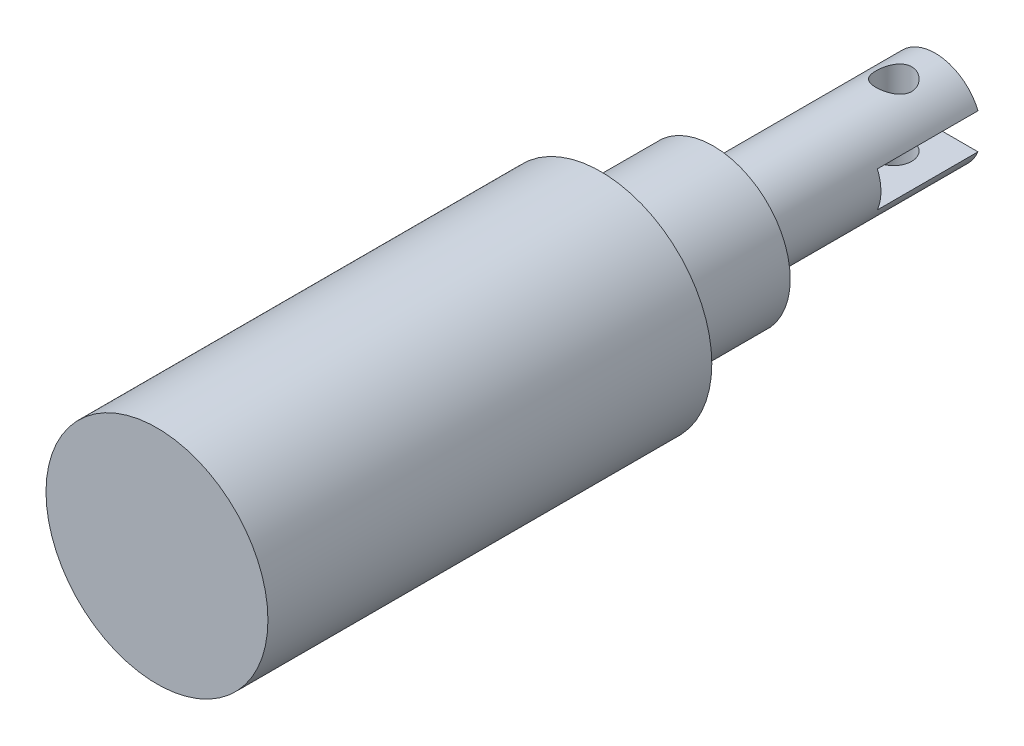
ISO-10303-21;
HEADER;
FILE_DESCRIPTION(('STEP AP214'),'2;1');
FILE_NAME('part.step','',(''),(''),'','','');
FILE_SCHEMA(('AUTOMOTIVE_DESIGN { 1 0 10303 214 1 1 1 1 }'));
ENDSEC;
DATA;
#1=APPLICATION_CONTEXT('core data for automotive mechanical design processes');
#2=APPLICATION_PROTOCOL_DEFINITION('international standard','automotive_design',2000,#1);
#3=PRODUCT_CONTEXT('',#1,'mechanical');
#4=PRODUCT('Part','Part','',(#3));
#5=PRODUCT_RELATED_PRODUCT_CATEGORY('part','',(#4));
#6=PRODUCT_DEFINITION_FORMATION('','',#4);
#7=PRODUCT_DEFINITION_CONTEXT('part definition',#1,'design');
#8=PRODUCT_DEFINITION('design','',#6,#7);
#9=PRODUCT_DEFINITION_SHAPE('','',#8);
#10=(LENGTH_UNIT() NAMED_UNIT(*) SI_UNIT(.MILLI.,.METRE.));
#11=(NAMED_UNIT(*) PLANE_ANGLE_UNIT() SI_UNIT($,.RADIAN.));
#12=(NAMED_UNIT(*) SI_UNIT($,.STERADIAN.) SOLID_ANGLE_UNIT());
#13=UNCERTAINTY_MEASURE_WITH_UNIT(LENGTH_MEASURE(1.E-05),#10,'distance_accuracy_value','');
#14=(GEOMETRIC_REPRESENTATION_CONTEXT(3) GLOBAL_UNCERTAINTY_ASSIGNED_CONTEXT((#13)) GLOBAL_UNIT_ASSIGNED_CONTEXT((#10,
#11,#12)) REPRESENTATION_CONTEXT('',''));
#15=CARTESIAN_POINT('',(0.,0.,0.));
#16=DIRECTION('',(0.,0.,1.));
#17=DIRECTION('',(1.,0.,0.));
#18=AXIS2_PLACEMENT_3D('',#15,#16,#17);
#19=CARTESIAN_POINT('',(0.,0.,-28.702));
#20=DIRECTION('',(0.,0.,-1.));
#21=DIRECTION('',(-1.,0.,0.));
#22=AXIS2_PLACEMENT_3D('',#19,#20,#21);
#23=PLANE('',#22);
#24=DIRECTION('',(1.,0.,0.));
#25=VECTOR('',#24,1.);
#26=CARTESIAN_POINT('',(0.,1.524,-28.702));
#27=LINE('',#26,#25);
#28=CARTESIAN_POINT('',(-3.67135451979239,1.524,-28.702));
#29=VERTEX_POINT('',#28);
#30=CARTESIAN_POINT('',(3.67135451979239,1.524,-28.702));
#31=VERTEX_POINT('',#30);
#32=EDGE_CURVE('E82',#29,#31,#27,.T.);
#33=ORIENTED_EDGE('',*,*,#32,.F.);
#34=CARTESIAN_POINT('',(0.,0.,-28.702));
#35=DIRECTION('',(0.,0.,-1.));
#36=DIRECTION('',(-1.,0.,0.));
#37=AXIS2_PLACEMENT_3D('',#34,#35,#36);
#38=CIRCLE('',#37,3.9751);
#39=EDGE_CURVE('E95',#29,#31,#38,.T.);
#40=ORIENTED_EDGE('',*,*,#39,.T.);
#41=EDGE_LOOP('',(#33,#40));
#42=FACE_BOUND('',#41,.T.);
#43=ADVANCED_FACE('F34',(#42),#23,.T.);
#44=CARTESIAN_POINT('',(0.,0.,-9.652));
#45=DIRECTION('',(0.,0.,-1.));
#46=DIRECTION('',(-1.,0.,0.));
#47=AXIS2_PLACEMENT_3D('',#44,#45,#46);
#48=PLANE('',#47);
#49=CARTESIAN_POINT('',(0.,0.,-9.652));
#50=DIRECTION('',(0.,0.,-1.));
#51=DIRECTION('',(-1.,0.,0.));
#52=AXIS2_PLACEMENT_3D('',#49,#50,#51);
#53=CIRCLE('',#52,6.604);
#54=CARTESIAN_POINT('',(-6.604,0.,-9.652));
#55=VERTEX_POINT('',#54);
#56=EDGE_CURVE('E99',#55,#55,#53,.T.);
#57=ORIENTED_EDGE('',*,*,#56,.T.);
#58=EDGE_LOOP('',(#57));
#59=FACE_BOUND('',#58,.T.);
#60=CARTESIAN_POINT('',(0.,0.,-9.652));
#61=DIRECTION('',(0.,0.,-1.));
#62=DIRECTION('',(-1.,0.,0.));
#63=AXIS2_PLACEMENT_3D('',#60,#61,#62);
#64=CIRCLE('',#63,3.9751);
#65=CARTESIAN_POINT('',(-3.9751,0.,-9.652));
#66=VERTEX_POINT('',#65);
#67=EDGE_CURVE('E96',#66,#66,#64,.T.);
#68=ORIENTED_EDGE('',*,*,#67,.F.);
#69=EDGE_LOOP('',(#68));
#70=FACE_BOUND('',#69,.T.);
#71=ADVANCED_FACE('F161',(#59,#70),#48,.T.);
#72=CARTESIAN_POINT('',(0.,0.,0.));
#73=DIRECTION('',(0.,0.,1.));
#74=DIRECTION('',(1.,0.,0.));
#75=AXIS2_PLACEMENT_3D('',#72,#73,#74);
#76=PLANE('',#75);
#77=CARTESIAN_POINT('',(0.,0.,0.));
#78=DIRECTION('',(0.,0.,1.));
#79=DIRECTION('',(1.,0.,0.));
#80=AXIS2_PLACEMENT_3D('',#77,#78,#79);
#81=CIRCLE('',#80,9.525);
#82=CARTESIAN_POINT('',(9.525,0.,0.));
#83=VERTEX_POINT('',#82);
#84=EDGE_CURVE('E107',#83,#83,#81,.T.);
#85=ORIENTED_EDGE('',*,*,#84,.F.);
#86=EDGE_LOOP('',(#85));
#87=FACE_BOUND('',#86,.T.);
#88=CARTESIAN_POINT('',(0.,0.,0.));
#89=DIRECTION('',(0.,0.,1.));
#90=DIRECTION('',(1.,0.,0.));
#91=AXIS2_PLACEMENT_3D('',#88,#89,#90);
#92=CIRCLE('',#91,6.604);
#93=CARTESIAN_POINT('',(6.604,0.,0.));
#94=VERTEX_POINT('',#93);
#95=EDGE_CURVE('E83',#94,#94,#92,.F.);
#96=ORIENTED_EDGE('',*,*,#95,.F.);
#97=EDGE_LOOP('',(#96));
#98=FACE_BOUND('',#97,.T.);
#99=ADVANCED_FACE('F166',(#87,#98),#76,.F.);
#100=CARTESIAN_POINT('',(0.,0.,38.1));
#101=DIRECTION('',(0.,0.,-1.));
#102=DIRECTION('',(-1.,0.,0.));
#103=AXIS2_PLACEMENT_3D('',#100,#101,#102);
#104=CYLINDRICAL_SURFACE('',#103,9.525);
#105=CARTESIAN_POINT('',(0.,0.,38.1));
#106=DIRECTION('',(0.,0.,1.));
#107=DIRECTION('',(1.,0.,0.));
#108=AXIS2_PLACEMENT_3D('',#105,#106,#107);
#109=CIRCLE('',#108,9.525);
#110=CARTESIAN_POINT('',(9.525,0.,38.1));
#111=VERTEX_POINT('',#110);
#112=EDGE_CURVE('E110',#111,#111,#109,.T.);
#113=ORIENTED_EDGE('',*,*,#112,.F.);
#114=EDGE_LOOP('',(#113));
#115=FACE_BOUND('',#114,.T.);
#116=ORIENTED_EDGE('',*,*,#84,.T.);
#117=EDGE_LOOP('',(#116));
#118=FACE_BOUND('',#117,.T.);
#119=ADVANCED_FACE('F36',(#115,#118),#104,.T.);
#120=CARTESIAN_POINT('',(0.,0.,38.1));
#121=DIRECTION('',(0.,0.,1.));
#122=DIRECTION('',(1.,0.,0.));
#123=AXIS2_PLACEMENT_3D('',#120,#121,#122);
#124=PLANE('',#123);
#125=ORIENTED_EDGE('',*,*,#112,.T.);
#126=EDGE_LOOP('',(#125));
#127=FACE_BOUND('',#126,.T.);
#128=ADVANCED_FACE('F176',(#127),#124,.T.);
#129=CARTESIAN_POINT('',(0.,0.,-9.652));
#130=DIRECTION('',(0.,0.,1.));
#131=DIRECTION('',(1.,0.,0.));
#132=AXIS2_PLACEMENT_3D('',#129,#130,#131);
#133=CYLINDRICAL_SURFACE('',#132,6.604);
#134=ORIENTED_EDGE('',*,*,#56,.F.);
#135=EDGE_LOOP('',(#134));
#136=FACE_BOUND('',#135,.T.);
#137=ORIENTED_EDGE('',*,*,#95,.T.);
#138=EDGE_LOOP('',(#137));
#139=FACE_BOUND('',#138,.T.);
#140=ADVANCED_FACE('F158',(#136,#139),#133,.T.);
#141=CARTESIAN_POINT('',(0.,0.,-28.702));
#142=DIRECTION('',(0.,0.,1.));
#143=DIRECTION('',(1.,0.,0.));
#144=AXIS2_PLACEMENT_3D('',#141,#142,#143);
#145=CYLINDRICAL_SURFACE('',#144,3.9751);
#146=CARTESIAN_POINT('',(0.,-3.9751,-23.6093));
#147=CARTESIAN_POINT('',(0.0830380894982347,-3.9751029806938,-23.6092961033103));
#148=CARTESIAN_POINT('',(0.166050383267687,-3.97247584886368,-23.6160513642807));
#149=CARTESIAN_POINT('',(0.329584181311895,-3.96225958594963,-23.6427763788338));
#150=CARTESIAN_POINT('',(0.410106208687314,-3.95467150447033,-23.6627433371844));
#151=CARTESIAN_POINT('',(0.566276493378778,-3.93534477224999,-23.715073348993));
#152=CARTESIAN_POINT('',(0.641934158795291,-3.92361443706282,-23.7474115779492));
#153=CARTESIAN_POINT('',(0.786742101338885,-3.89716328569474,-23.8234357791034));
#154=CARTESIAN_POINT('',(0.855890516440798,-3.88244161759914,-23.8671249849853));
#155=CARTESIAN_POINT('',(0.988809285528758,-3.85078346873806,-23.9666478095951));
#156=CARTESIAN_POINT('',(1.05225057511994,-3.83378163796224,-24.0228999128649));
#157=CARTESIAN_POINT('',(1.16906783530413,-3.79979056415889,-24.1450633450638));
#158=CARTESIAN_POINT('',(1.2224404378886,-3.78280132723024,-24.2109778930563));
#159=CARTESIAN_POINT('',(1.31976391728373,-3.74998579233273,-24.3538868073146));
#160=CARTESIAN_POINT('',(1.36323872732565,-3.73423574426588,-24.4312246670783));
#161=CARTESIAN_POINT('',(1.4364168594696,-3.70670563656035,-24.592817856327));
#162=CARTESIAN_POINT('',(1.46612607567058,-3.69492387838578,-24.677070206968));
#163=CARTESIAN_POINT('',(1.50961201037139,-3.67736636399404,-24.8463041896061));
#164=CARTESIAN_POINT('',(1.52401948364219,-3.67135391407232,-24.931098328155));
#165=CARTESIAN_POINT('',(1.5384644750005,-3.665325991539,-25.1020975576534));
#166=CARTESIAN_POINT('',(1.5385084162159,-3.66530783837952,-25.1883020006915));
#167=CARTESIAN_POINT('',(1.52470535473133,-3.67106749029638,-25.3537747457893));
#168=CARTESIAN_POINT('',(1.51175051657555,-3.67647304141678,-25.4331328814722));
#169=CARTESIAN_POINT('',(1.47379833169538,-3.69184957167249,-25.5884461994993));
#170=CARTESIAN_POINT('',(1.44879905310381,-3.70182128318405,-25.6644008338024));
#171=CARTESIAN_POINT('',(1.38700403741426,-3.72541918812199,-25.8125088409953));
#172=CARTESIAN_POINT('',(1.34998633026831,-3.73911328823974,-25.8845583027187));
#173=CARTESIAN_POINT('',(1.26536042569286,-3.76859217903469,-26.0216749238049));
#174=CARTESIAN_POINT('',(1.21774841540283,-3.78437772158667,-26.0867395568175));
#175=CARTESIAN_POINT('',(1.10926459633293,-3.81764207808103,-26.2129533862858));
#176=CARTESIAN_POINT('',(1.04768632189708,-3.8351611028321,-26.2734863123813));
#177=CARTESIAN_POINT('',(0.915057315823779,-3.86894932284617,-26.3835559647981));
#178=CARTESIAN_POINT('',(0.844004943543562,-3.88521830086596,-26.433090782593));
#179=CARTESIAN_POINT('',(0.692792686158952,-3.91503390905353,-26.520495718632));
#180=CARTESIAN_POINT('',(0.612496148411962,-3.92852839645976,-26.558148491541));
#181=CARTESIAN_POINT('',(0.446055800553947,-3.95088451493021,-26.6192033656615));
#182=CARTESIAN_POINT('',(0.359914778750758,-3.95974833789132,-26.6426122100161));
#183=CARTESIAN_POINT('',(0.189407865526704,-3.97145261179298,-26.6733019493625));
#184=CARTESIAN_POINT('',(0.105212322456653,-3.97460232999082,-26.6814119426118));
#185=CARTESIAN_POINT('',(-0.0633865089390949,-3.97548764711835,-26.6837034413665));
#186=CARTESIAN_POINT('',(-0.147789742923662,-3.97322453723792,-26.6778882686164));
#187=CARTESIAN_POINT('',(-0.310745600504053,-3.96374191093432,-26.6531156092067));
#188=CARTESIAN_POINT('',(-0.389395821774841,-3.95673125929177,-26.6347116268862));
#189=CARTESIAN_POINT('',(-0.542428899752999,-3.93867137326789,-26.5860236375393));
#190=CARTESIAN_POINT('',(-0.616811202090119,-3.92762161560513,-26.5557380911743));
#191=CARTESIAN_POINT('',(-0.761702917083166,-3.90215385006175,-26.4831678452456));
#192=CARTESIAN_POINT('',(-0.83202912344978,-3.88764471494833,-26.4405503358335));
#193=CARTESIAN_POINT('',(-0.964773399877488,-3.85684886036941,-26.3448987324591));
#194=CARTESIAN_POINT('',(-1.02718841276093,-3.84056145821401,-26.2918606316626));
#195=CARTESIAN_POINT('',(-1.14637181915741,-3.80674721919624,-26.1730288323215));
#196=CARTESIAN_POINT('',(-1.20255429098789,-3.78920590883894,-26.1066500616832));
#197=CARTESIAN_POINT('',(-1.30311142899317,-3.75581359694204,-25.965076563306));
#198=CARTESIAN_POINT('',(-1.34748465650101,-3.73996280149106,-25.8898807630342));
#199=CARTESIAN_POINT('',(-1.42330939759957,-3.71177394459548,-25.7319643908416));
#200=CARTESIAN_POINT('',(-1.45467465840069,-3.69945949220477,-25.6491978973582));
#201=CARTESIAN_POINT('',(-1.50279969909284,-3.68017636919458,-25.4789438370654));
#202=CARTESIAN_POINT('',(-1.51956929909603,-3.67320410467416,-25.3914594866284));
#203=CARTESIAN_POINT('',(-1.53712104106077,-3.66589154637158,-25.2206460734946));
#204=CARTESIAN_POINT('',(-1.53891039165668,-3.6651335118221,-25.1374376284623));
#205=CARTESIAN_POINT('',(-1.52906083673222,-3.66925348245713,-24.9719696492659));
#206=CARTESIAN_POINT('',(-1.51742337900248,-3.67413087998236,-24.8897100137592));
#207=CARTESIAN_POINT('',(-1.48185285694508,-3.68861475037555,-24.7313672590042));
#208=CARTESIAN_POINT('',(-1.45835766006208,-3.69805233538713,-24.6551689664657));
#209=CARTESIAN_POINT('',(-1.4001350818281,-3.72048520812047,-24.5077576051675));
#210=CARTESIAN_POINT('',(-1.36540478108963,-3.73348142039941,-24.4365458379893));
#211=CARTESIAN_POINT('',(-1.28349674615039,-3.76245117349394,-24.2968885113173));
#212=CARTESIAN_POINT('',(-1.23574193058826,-3.77854871045546,-24.2288074854954));
#213=CARTESIAN_POINT('',(-1.13001062675685,-3.81150365272091,-24.1013050558573));
#214=CARTESIAN_POINT('',(-1.07203078869622,-3.82836130569309,-24.0418865016182));
#215=CARTESIAN_POINT('',(-0.943415859281925,-3.86213076265507,-23.9298148872565));
#216=CARTESIAN_POINT('',(-0.872236257382769,-3.8789871869923,-23.8777670658039));
#217=CARTESIAN_POINT('',(-0.721544712543524,-3.90982159606638,-23.7863726296693));
#218=CARTESIAN_POINT('',(-0.642031215521395,-3.92379904249319,-23.7470283895182));
#219=CARTESIAN_POINT('',(-0.471012896609513,-3.94810315731587,-23.6801928342344));
#220=CARTESIAN_POINT('',(-0.379058426185178,-3.95810660587897,-23.6537214590898));
#221=CARTESIAN_POINT('',(-0.191389724843978,-3.97160139486835,-23.6182824346457));
#222=CARTESIAN_POINT('',(-0.0956777392224007,-3.97509656559965,-23.6093044898247));
#223=CARTESIAN_POINT('',(0.,-3.9751,-23.6093));
#224=B_SPLINE_CURVE_WITH_KNOTS('',3,(#146,#147,#148,#149,#150,#151,#152,#153,#154,#155,#156,
#157,#158,#159,#160,#161,#162,#163,#164,#165,#166,#167,#168,#169,#170,#171,#172,#173,#174,#175,
#176,#177,#178,#179,#180,#181,#182,#183,#184,#185,#186,#187,#188,#189,#190,#191,#192,#193,#194,
#195,#196,#197,#198,#199,#200,#201,#202,#203,#204,#205,#206,#207,#208,#209,#210,#211,#212,#213,
#214,#215,#216,#217,#218,#219,#220,#221,#222,#223),.UNSPECIFIED.,.T.,.F.,(4,2,2,2,2,2,2,2,2,2,2,
2,2,2,2,2,2,2,2,2,2,2,2,2,2,2,2,2,2,2,2,2,2,2,2,2,2,2,4),(0.,0.248761156411061,
0.497469698620771,0.745681771788006,0.993964633678405,1.25225386807937,1.51062934846253,
1.77959928462661,2.04845394761117,2.30573600720731,2.56290301447303,2.80354976797622,
3.04423513285523,3.28964601298231,3.53514535907688,3.79826634015716,4.06143294558598,
4.32916650826577,4.59677322580282,4.8494069791102,5.10198047452511,5.34410770606109,
5.58626631721738,5.83569188060921,6.08521353928717,6.35012915480844,6.61507702904576,
6.88175465737973,7.14825272322924,7.39667549323656,7.6450714787292,7.88490126299054,
8.12479341598759,8.37781108018318,8.63091178930224,8.89893144764616,9.16700117478869,
9.45379637185945,9.74042272845772),.UNSPECIFIED.);
#225=CARTESIAN_POINT('',(0.,-3.9751,-23.6093));
#226=VERTEX_POINT('',#225);
#227=EDGE_CURVE('E126',#226,#226,#224,.T.);
#228=ORIENTED_EDGE('',*,*,#227,.T.);
#229=EDGE_LOOP('',(#228));
#230=FACE_BOUND('',#229,.T.);
#231=CARTESIAN_POINT('',(0.,3.9751,-23.6093));
#232=CARTESIAN_POINT('',(-0.0830380894982348,3.9751029806938,-23.6092961033103));
#233=CARTESIAN_POINT('',(-0.166050383267687,3.97247584886368,-23.6160513642807));
#234=CARTESIAN_POINT('',(-0.329584181311895,3.96225958594963,-23.6427763788338));
#235=CARTESIAN_POINT('',(-0.410106208687314,3.95467150447033,-23.6627433371844));
#236=CARTESIAN_POINT('',(-0.566276493378778,3.93534477224999,-23.715073348993));
#237=CARTESIAN_POINT('',(-0.641934158795291,3.92361443706282,-23.7474115779492));
#238=CARTESIAN_POINT('',(-0.786742101338885,3.89716328569474,-23.8234357791034));
#239=CARTESIAN_POINT('',(-0.855890516440799,3.88244161759914,-23.8671249849853));
#240=CARTESIAN_POINT('',(-0.988809285528759,3.85078346873806,-23.9666478095951));
#241=CARTESIAN_POINT('',(-1.05225057511994,3.83378163796224,-24.0228999128649));
#242=CARTESIAN_POINT('',(-1.16906783530413,3.79979056415889,-24.1450633450638));
#243=CARTESIAN_POINT('',(-1.2224404378886,3.78280132723024,-24.2109778930563));
#244=CARTESIAN_POINT('',(-1.31976391728373,3.74998579233273,-24.3538868073146));
#245=CARTESIAN_POINT('',(-1.36323872732565,3.73423574426588,-24.4312246670783));
#246=CARTESIAN_POINT('',(-1.4364168594696,3.70670563656035,-24.592817856327));
#247=CARTESIAN_POINT('',(-1.46612607567059,3.69492387838578,-24.677070206968));
#248=CARTESIAN_POINT('',(-1.50961201037139,3.67736636399404,-24.8463041896061));
#249=CARTESIAN_POINT('',(-1.52401948364219,3.67135391407232,-24.931098328155));
#250=CARTESIAN_POINT('',(-1.5384644750005,3.665325991539,-25.1020975576534));
#251=CARTESIAN_POINT('',(-1.5385084162159,3.66530783837952,-25.1883020006915));
#252=CARTESIAN_POINT('',(-1.52470535473133,3.67106749029638,-25.3537747457893));
#253=CARTESIAN_POINT('',(-1.51175051657555,3.67647304141678,-25.4331328814722));
#254=CARTESIAN_POINT('',(-1.47379833169538,3.69184957167249,-25.5884461994993));
#255=CARTESIAN_POINT('',(-1.44879905310381,3.70182128318405,-25.6644008338024));
#256=CARTESIAN_POINT('',(-1.38700403741427,3.72541918812199,-25.8125088409953));
#257=CARTESIAN_POINT('',(-1.34998633026831,3.73911328823974,-25.8845583027187));
#258=CARTESIAN_POINT('',(-1.26536042569287,3.76859217903469,-26.0216749238049));
#259=CARTESIAN_POINT('',(-1.21774841540283,3.78437772158667,-26.0867395568175));
#260=CARTESIAN_POINT('',(-1.10926459633294,3.81764207808103,-26.2129533862858));
#261=CARTESIAN_POINT('',(-1.04768632189708,3.83516110283209,-26.2734863123813));
#262=CARTESIAN_POINT('',(-0.915057315823782,3.86894932284617,-26.3835559647981));
#263=CARTESIAN_POINT('',(-0.844004943543565,3.88521830086596,-26.433090782593));
#264=CARTESIAN_POINT('',(-0.692792686158953,3.91503390905353,-26.520495718632));
#265=CARTESIAN_POINT('',(-0.612496148411963,3.92852839645976,-26.558148491541));
#266=CARTESIAN_POINT('',(-0.446055800553948,3.95088451493021,-26.6192033656615));
#267=CARTESIAN_POINT('',(-0.359914778750758,3.95974833789132,-26.6426122100161));
#268=CARTESIAN_POINT('',(-0.189407865526704,3.97145261179298,-26.6733019493625));
#269=CARTESIAN_POINT('',(-0.105212322456652,3.97460232999082,-26.6814119426118));
#270=CARTESIAN_POINT('',(0.0633865089390958,3.97548764711835,-26.6837034413665));
#271=CARTESIAN_POINT('',(0.147789742923663,3.97322453723792,-26.6778882686164));
#272=CARTESIAN_POINT('',(0.310745600504054,3.96374191093432,-26.6531156092067));
#273=CARTESIAN_POINT('',(0.389395821774842,3.95673125929177,-26.6347116268862));
#274=CARTESIAN_POINT('',(0.542428899753,3.93867137326789,-26.5860236375393));
#275=CARTESIAN_POINT('',(0.61681120209012,3.92762161560513,-26.5557380911743));
#276=CARTESIAN_POINT('',(0.761702917083166,3.90215385006175,-26.4831678452456));
#277=CARTESIAN_POINT('',(0.832029123449781,3.88764471494833,-26.4405503358335));
#278=CARTESIAN_POINT('',(0.96477339987749,3.85684886036941,-26.3448987324591));
#279=CARTESIAN_POINT('',(1.02718841276093,3.84056145821401,-26.2918606316626));
#280=CARTESIAN_POINT('',(1.14637181915741,3.80674721919624,-26.1730288323215));
#281=CARTESIAN_POINT('',(1.20255429098789,3.78920590883894,-26.1066500616832));
#282=CARTESIAN_POINT('',(1.30311142899317,3.75581359694204,-25.965076563306));
#283=CARTESIAN_POINT('',(1.34748465650102,3.73996280149106,-25.8898807630342));
#284=CARTESIAN_POINT('',(1.42330939759958,3.71177394459548,-25.7319643908416));
#285=CARTESIAN_POINT('',(1.45467465840069,3.69945949220477,-25.6491978973582));
#286=CARTESIAN_POINT('',(1.50279969909284,3.68017636919458,-25.4789438370654));
#287=CARTESIAN_POINT('',(1.51956929909603,3.67320410467416,-25.3914594866284));
#288=CARTESIAN_POINT('',(1.53712104106077,3.66589154637158,-25.2206460734946));
#289=CARTESIAN_POINT('',(1.53891039165668,3.6651335118221,-25.1374376284623));
#290=CARTESIAN_POINT('',(1.52906083673222,3.66925348245713,-24.9719696492659));
#291=CARTESIAN_POINT('',(1.51742337900248,3.67413087998236,-24.8897100137592));
#292=CARTESIAN_POINT('',(1.48185285694508,3.68861475037555,-24.7313672590042));
#293=CARTESIAN_POINT('',(1.45835766006208,3.69805233538713,-24.6551689664657));
#294=CARTESIAN_POINT('',(1.4001350818281,3.72048520812047,-24.5077576051675));
#295=CARTESIAN_POINT('',(1.36540478108963,3.73348142039941,-24.4365458379893));
#296=CARTESIAN_POINT('',(1.28349674615038,3.76245117349394,-24.2968885113173));
#297=CARTESIAN_POINT('',(1.23574193058825,3.77854871045546,-24.2288074854954));
#298=CARTESIAN_POINT('',(1.13001062675684,3.81150365272091,-24.1013050558573));
#299=CARTESIAN_POINT('',(1.07203078869622,3.82836130569309,-24.0418865016182));
#300=CARTESIAN_POINT('',(0.943415859281922,3.86213076265507,-23.9298148872565));
#301=CARTESIAN_POINT('',(0.872236257382767,3.8789871869923,-23.8777670658039));
#302=CARTESIAN_POINT('',(0.721544712543523,3.90982159606638,-23.7863726296693));
#303=CARTESIAN_POINT('',(0.642031215521395,3.92379904249319,-23.7470283895182));
#304=CARTESIAN_POINT('',(0.471012896609513,3.94810315731587,-23.6801928342344));
#305=CARTESIAN_POINT('',(0.379058426185177,3.95810660587897,-23.6537214590898));
#306=CARTESIAN_POINT('',(0.191389724843977,3.97160139486835,-23.6182824346457));
#307=CARTESIAN_POINT('',(0.0956777392224002,3.97509656559965,-23.6093044898247));
#308=CARTESIAN_POINT('',(0.,3.9751,-23.6093));
#309=B_SPLINE_CURVE_WITH_KNOTS('',3,(#231,#232,#233,#234,#235,#236,#237,#238,#239,#240,#241,
#242,#243,#244,#245,#246,#247,#248,#249,#250,#251,#252,#253,#254,#255,#256,#257,#258,#259,#260,
#261,#262,#263,#264,#265,#266,#267,#268,#269,#270,#271,#272,#273,#274,#275,#276,#277,#278,#279,
#280,#281,#282,#283,#284,#285,#286,#287,#288,#289,#290,#291,#292,#293,#294,#295,#296,#297,#298,
#299,#300,#301,#302,#303,#304,#305,#306,#307,#308),.UNSPECIFIED.,.T.,.F.,(4,2,2,2,2,2,2,2,2,2,2,
2,2,2,2,2,2,2,2,2,2,2,2,2,2,2,2,2,2,2,2,2,2,2,2,2,2,2,4),(0.,0.248761156411061,
0.497469698620772,0.745681771788007,0.993964633678406,1.25225386807937,1.51062934846253,
1.77959928462661,2.04845394761117,2.30573600720731,2.56290301447303,2.80354976797622,
3.04423513285523,3.28964601298231,3.53514535907687,3.79826634015716,4.06143294558598,
4.32916650826577,4.59677322580282,4.8494069791102,5.10198047452511,5.34410770606109,
5.58626631721738,5.83569188060921,6.08521353928717,6.35012915480845,6.61507702904577,
6.88175465737974,7.14825272322924,7.39667549323656,7.6450714787292,7.88490126299054,
8.1247934159876,8.3778110801832,8.63091178930224,8.89893144764616,9.16700117478869,
9.45379637185945,9.74042272845772),.UNSPECIFIED.);
#310=CARTESIAN_POINT('',(0.,3.9751,-23.6093));
#311=VERTEX_POINT('',#310);
#312=EDGE_CURVE('E133',#311,#311,#309,.T.);
#313=ORIENTED_EDGE('',*,*,#312,.T.);
#314=EDGE_LOOP('',(#313));
#315=FACE_BOUND('',#314,.T.);
#316=CARTESIAN_POINT('',(0.,0.,-20.066));
#317=DIRECTION('',(0.,0.,-1.));
#318=DIRECTION('',(-1.,0.,0.));
#319=AXIS2_PLACEMENT_3D('',#316,#317,#318);
#320=CIRCLE('',#319,3.9751);
#321=CARTESIAN_POINT('',(3.67135451979239,1.524,-20.066));
#322=VERTEX_POINT('',#321);
#323=CARTESIAN_POINT('',(3.67135451979239,-1.524,-20.066));
#324=VERTEX_POINT('',#323);
#325=EDGE_CURVE('E11',#322,#324,#320,.T.);
#326=ORIENTED_EDGE('',*,*,#325,.F.);
#327=DIRECTION('',(0.,0.,1.));
#328=VECTOR('',#327,1.);
#329=CARTESIAN_POINT('',(3.67135451979239,1.524,-28.702));
#330=LINE('',#329,#328);
#331=EDGE_CURVE('E58',#322,#31,#330,.F.);
#332=ORIENTED_EDGE('',*,*,#331,.T.);
#333=ORIENTED_EDGE('',*,*,#39,.F.);
#334=DIRECTION('',(0.,0.,1.));
#335=VECTOR('',#334,1.);
#336=CARTESIAN_POINT('',(-3.67135451979239,1.524,-28.702));
#337=LINE('',#336,#335);
#338=CARTESIAN_POINT('',(-3.67135451979239,1.524,-20.066));
#339=VERTEX_POINT('',#338);
#340=EDGE_CURVE('E101',#29,#339,#337,.T.);
#341=ORIENTED_EDGE('',*,*,#340,.T.);
#342=CARTESIAN_POINT('',(-3.67135451979239,-1.524,-20.066));
#343=VERTEX_POINT('',#342);
#344=EDGE_CURVE('E43',#343,#339,#320,.T.);
#345=ORIENTED_EDGE('',*,*,#344,.F.);
#346=DIRECTION('',(0.,0.,1.));
#347=VECTOR('',#346,1.);
#348=CARTESIAN_POINT('',(-3.67135451979239,-1.524,-28.702));
#349=LINE('',#348,#347);
#350=CARTESIAN_POINT('',(-3.67135451979239,-1.524,-28.702));
#351=VERTEX_POINT('',#350);
#352=EDGE_CURVE('E77',#343,#351,#349,.F.);
#353=ORIENTED_EDGE('',*,*,#352,.T.);
#354=CARTESIAN_POINT('',(3.67135451979239,-1.524,-28.702));
#355=VERTEX_POINT('',#354);
#356=EDGE_CURVE('E90',#355,#351,#38,.T.);
#357=ORIENTED_EDGE('',*,*,#356,.F.);
#358=DIRECTION('',(0.,0.,1.));
#359=VECTOR('',#358,1.);
#360=CARTESIAN_POINT('',(3.67135451979239,-1.524,-28.702));
#361=LINE('',#360,#359);
#362=EDGE_CURVE('E50',#355,#324,#361,.T.);
#363=ORIENTED_EDGE('',*,*,#362,.T.);
#364=EDGE_LOOP('',(#326,#332,#333,#341,#345,#353,#357,#363));
#365=FACE_BOUND('',#364,.T.);
#366=ORIENTED_EDGE('',*,*,#67,.T.);
#367=EDGE_LOOP('',(#366));
#368=FACE_BOUND('',#367,.T.);
#369=ADVANCED_FACE('F88',(#230,#315,#365,#368),#145,.T.);
#370=DIRECTION('',(-1.,0.,0.));
#371=VECTOR('',#370,1.);
#372=CARTESIAN_POINT('',(0.,-1.524,-28.702));
#373=LINE('',#372,#371);
#374=EDGE_CURVE('E74',#355,#351,#373,.T.);
#375=ORIENTED_EDGE('',*,*,#374,.F.);
#376=ORIENTED_EDGE('',*,*,#356,.T.);
#377=EDGE_LOOP('',(#375,#376));
#378=FACE_BOUND('',#377,.T.);
#379=ADVANCED_FACE('F94',(#378),#23,.T.);
#380=CARTESIAN_POINT('',(5.01600775193798,-1.524,-20.066));
#381=DIRECTION('',(0.,0.,-1.));
#382=DIRECTION('',(-1.,0.,0.));
#383=AXIS2_PLACEMENT_3D('',#380,#381,#382);
#384=PLANE('',#383);
#385=ORIENTED_EDGE('',*,*,#325,.T.);
#386=DIRECTION('',(-1.,0.,0.));
#387=VECTOR('',#386,1.);
#388=CARTESIAN_POINT('',(5.01600775193798,-1.524,-20.066));
#389=LINE('',#388,#387);
#390=EDGE_CURVE('E117',#324,#343,#389,.T.);
#391=ORIENTED_EDGE('',*,*,#390,.T.);
#392=ORIENTED_EDGE('',*,*,#344,.T.);
#393=DIRECTION('',(1.,0.,0.));
#394=VECTOR('',#393,1.);
#395=CARTESIAN_POINT('',(5.01600775193798,1.524,-20.066));
#396=LINE('',#395,#394);
#397=EDGE_CURVE('E92',#339,#322,#396,.T.);
#398=ORIENTED_EDGE('',*,*,#397,.T.);
#399=EDGE_LOOP('',(#385,#391,#392,#398));
#400=FACE_BOUND('',#399,.T.);
#401=ADVANCED_FACE('F116',(#400),#384,.T.);
#402=CARTESIAN_POINT('',(5.01600775193798,1.524,-20.066));
#403=DIRECTION('',(0.,1.,0.));
#404=DIRECTION('',(0.,0.,1.));
#405=AXIS2_PLACEMENT_3D('',#402,#403,#404);
#406=PLANE('',#405);
#407=CARTESIAN_POINT('',(0.,1.524,-25.146));
#408=DIRECTION('',(0.,1.,0.));
#409=DIRECTION('',(0.,0.,1.));
#410=AXIS2_PLACEMENT_3D('',#407,#408,#409);
#411=CIRCLE('',#410,1.5367);
#412=CARTESIAN_POINT('',(0.,1.524,-23.6093));
#413=VERTEX_POINT('',#412);
#414=EDGE_CURVE('E261',#413,#413,#411,.T.);
#415=ORIENTED_EDGE('',*,*,#414,.T.);
#416=EDGE_LOOP('',(#415));
#417=FACE_BOUND('',#416,.T.);
#418=ORIENTED_EDGE('',*,*,#32,.T.);
#419=ORIENTED_EDGE('',*,*,#331,.F.);
#420=ORIENTED_EDGE('',*,*,#397,.F.);
#421=ORIENTED_EDGE('',*,*,#340,.F.);
#422=EDGE_LOOP('',(#418,#419,#420,#421));
#423=FACE_BOUND('',#422,.T.);
#424=ADVANCED_FACE('F118',(#417,#423),#406,.F.);
#425=CARTESIAN_POINT('',(5.01600775193798,-1.524,-20.066));
#426=DIRECTION('',(0.,-1.,0.));
#427=DIRECTION('',(0.,0.,-1.));
#428=AXIS2_PLACEMENT_3D('',#425,#426,#427);
#429=PLANE('',#428);
#430=CARTESIAN_POINT('',(0.,-1.524,-25.146));
#431=DIRECTION('',(0.,-1.,0.));
#432=DIRECTION('',(0.,0.,-1.));
#433=AXIS2_PLACEMENT_3D('',#430,#431,#432);
#434=CIRCLE('',#433,1.5367);
#435=CARTESIAN_POINT('',(0.,-1.524,-26.6827));
#436=VERTEX_POINT('',#435);
#437=EDGE_CURVE('E38',#436,#436,#434,.T.);
#438=ORIENTED_EDGE('',*,*,#437,.T.);
#439=EDGE_LOOP('',(#438));
#440=FACE_BOUND('',#439,.T.);
#441=ORIENTED_EDGE('',*,*,#374,.T.);
#442=ORIENTED_EDGE('',*,*,#352,.F.);
#443=ORIENTED_EDGE('',*,*,#390,.F.);
#444=ORIENTED_EDGE('',*,*,#362,.F.);
#445=EDGE_LOOP('',(#441,#442,#443,#444));
#446=FACE_BOUND('',#445,.T.);
#447=ADVANCED_FACE('F76',(#440,#446),#429,.F.);
#448=CARTESIAN_POINT('',(0.,-9.525,-25.146));
#449=DIRECTION('',(0.,1.,0.));
#450=DIRECTION('',(0.,0.,1.));
#451=AXIS2_PLACEMENT_3D('',#448,#449,#450);
#452=CYLINDRICAL_SURFACE('',#451,1.5367);
#453=ORIENTED_EDGE('',*,*,#437,.F.);
#454=EDGE_LOOP('',(#453));
#455=FACE_BOUND('',#454,.T.);
#456=ORIENTED_EDGE('',*,*,#227,.F.);
#457=EDGE_LOOP('',(#456));
#458=FACE_BOUND('',#457,.T.);
#459=ADVANCED_FACE('F140',(#455,#458),#452,.F.);
#460=ORIENTED_EDGE('',*,*,#414,.F.);
#461=EDGE_LOOP('',(#460));
#462=FACE_BOUND('',#461,.T.);
#463=ORIENTED_EDGE('',*,*,#312,.F.);
#464=EDGE_LOOP('',(#463));
#465=FACE_BOUND('',#464,.T.);
#466=ADVANCED_FACE('F144',(#462,#465),#452,.F.);
#467=CLOSED_SHELL('',(#43,#71,#99,#119,#128,#140,#369,#379,#401,#424,#447,#459,#466));
#468=MANIFOLD_SOLID_BREP('B2',#467);
#469=ADVANCED_BREP_SHAPE_REPRESENTATION('',(#18,#468),#14);
#470=SHAPE_DEFINITION_REPRESENTATION(#9,#469);
ENDSEC;
END-ISO-10303-21;
